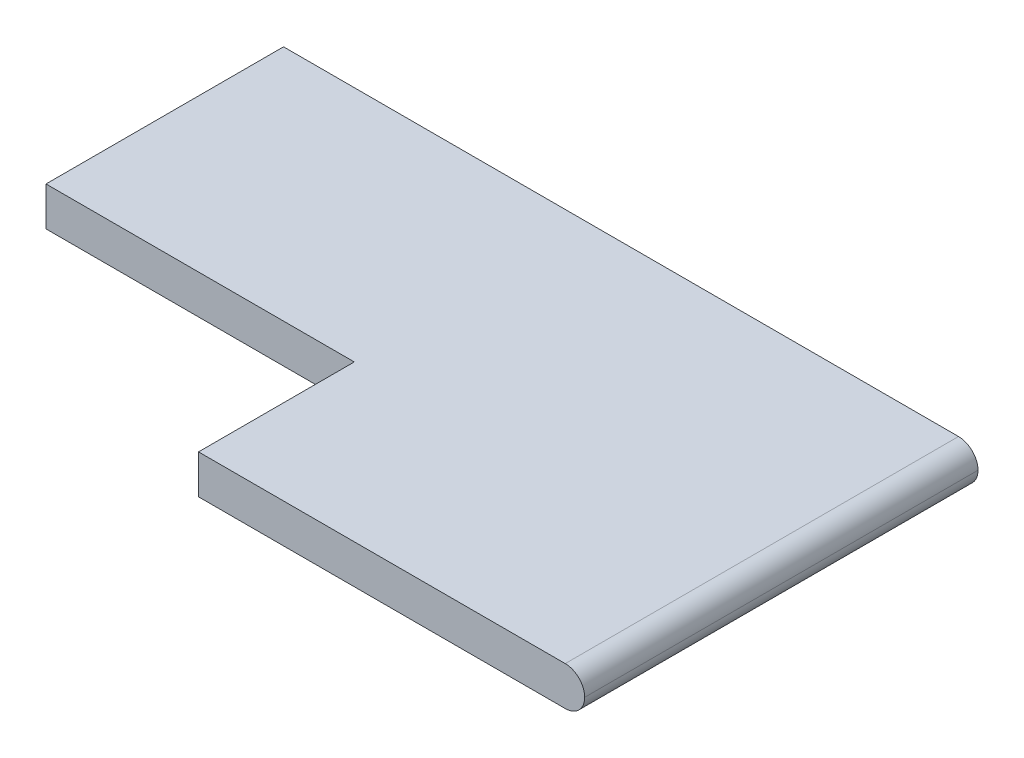
ISO-10303-21;
HEADER;
FILE_DESCRIPTION(('STEP AP214'),'2;1');
FILE_NAME('part.step','',(''),(''),'','','');
FILE_SCHEMA(('AUTOMOTIVE_DESIGN { 1 0 10303 214 1 1 1 1 }'));
ENDSEC;
DATA;
#1=APPLICATION_CONTEXT('core data for automotive mechanical design processes');
#2=APPLICATION_PROTOCOL_DEFINITION('international standard','automotive_design',2000,#1);
#3=PRODUCT_CONTEXT('',#1,'mechanical');
#4=PRODUCT('Part','Part','',(#3));
#5=PRODUCT_RELATED_PRODUCT_CATEGORY('part','',(#4));
#6=PRODUCT_DEFINITION_FORMATION('','',#4);
#7=PRODUCT_DEFINITION_CONTEXT('part definition',#1,'design');
#8=PRODUCT_DEFINITION('design','',#6,#7);
#9=PRODUCT_DEFINITION_SHAPE('','',#8);
#10=(LENGTH_UNIT() NAMED_UNIT(*) SI_UNIT(.MILLI.,.METRE.));
#11=(NAMED_UNIT(*) PLANE_ANGLE_UNIT() SI_UNIT($,.RADIAN.));
#12=(NAMED_UNIT(*) SI_UNIT($,.STERADIAN.) SOLID_ANGLE_UNIT());
#13=UNCERTAINTY_MEASURE_WITH_UNIT(LENGTH_MEASURE(1.E-05),#10,'distance_accuracy_value','');
#14=(GEOMETRIC_REPRESENTATION_CONTEXT(3) GLOBAL_UNCERTAINTY_ASSIGNED_CONTEXT((#13)) GLOBAL_UNIT_ASSIGNED_CONTEXT((#10,
#11,#12)) REPRESENTATION_CONTEXT('',''));
#15=CARTESIAN_POINT('',(0.,0.,0.));
#16=DIRECTION('',(0.,0.,1.));
#17=DIRECTION('',(1.,0.,0.));
#18=AXIS2_PLACEMENT_3D('',#15,#16,#17);
#19=CARTESIAN_POINT('',(-4.25,0.,83.8840461331542));
#20=DIRECTION('',(1.,0.,0.));
#21=DIRECTION('',(0.,0.,-1.));
#22=AXIS2_PLACEMENT_3D('',#19,#20,#21);
#23=PLANE('',#22);
#24=DIRECTION('',(0.,-1.,0.));
#25=VECTOR('',#24,1.);
#26=CARTESIAN_POINT('',(-4.25,1.5,18.3));
#27=LINE('',#26,#25);
#28=CARTESIAN_POINT('',(-4.25,1.5,18.3));
#29=VERTEX_POINT('',#28);
#30=CARTESIAN_POINT('',(-4.25,-1.5,18.3));
#31=VERTEX_POINT('',#30);
#32=EDGE_CURVE('E95',#29,#31,#27,.T.);
#33=ORIENTED_EDGE('',*,*,#32,.F.);
#34=DIRECTION('',(0.,0.,-1.));
#35=VECTOR('',#34,1.);
#36=CARTESIAN_POINT('',(-4.25,1.5,83.8840461331542));
#37=LINE('',#36,#35);
#38=CARTESIAN_POINT('',(-4.25,1.5,0.));
#39=VERTEX_POINT('',#38);
#40=EDGE_CURVE('E121',#29,#39,#37,.T.);
#41=ORIENTED_EDGE('',*,*,#40,.T.);
#42=DIRECTION('',(0.,-1.,0.));
#43=VECTOR('',#42,1.);
#44=CARTESIAN_POINT('',(-4.25,0.,0.));
#45=LINE('',#44,#43);
#46=CARTESIAN_POINT('',(-4.25,-1.5,0.));
#47=VERTEX_POINT('',#46);
#48=EDGE_CURVE('E115',#39,#47,#45,.T.);
#49=ORIENTED_EDGE('',*,*,#48,.T.);
#50=DIRECTION('',(0.,0.,-1.));
#51=VECTOR('',#50,1.);
#52=CARTESIAN_POINT('',(-4.25,-1.5,83.8840461331542));
#53=LINE('',#52,#51);
#54=EDGE_CURVE('E109',#31,#47,#53,.T.);
#55=ORIENTED_EDGE('',*,*,#54,.F.);
#56=EDGE_LOOP('',(#33,#41,#49,#55));
#57=FACE_BOUND('',#56,.T.);
#58=ADVANCED_FACE('F35',(#57),#23,.F.);
#59=CARTESIAN_POINT('',(0.,1.5,83.8840461331542));
#60=DIRECTION('',(0.,1.,0.));
#61=DIRECTION('',(0.,0.,1.));
#62=AXIS2_PLACEMENT_3D('',#59,#60,#61);
#63=PLANE('',#62);
#64=DIRECTION('',(1.,0.,0.));
#65=VECTOR('',#64,1.);
#66=CARTESIAN_POINT('',(0.,1.5,30.3));
#67=LINE('',#66,#65);
#68=CARTESIAN_POINT('',(19.5,1.5,30.3));
#69=VERTEX_POINT('',#68);
#70=CARTESIAN_POINT('',(47.75,1.5,30.3));
#71=VERTEX_POINT('',#70);
#72=EDGE_CURVE('E140',#69,#71,#67,.T.);
#73=ORIENTED_EDGE('',*,*,#72,.T.);
#74=DIRECTION('',(0.,0.,-1.));
#75=VECTOR('',#74,1.);
#76=CARTESIAN_POINT('',(47.75,1.5,83.8840461331542));
#77=LINE('',#76,#75);
#78=CARTESIAN_POINT('',(47.75,1.5,0.));
#79=VERTEX_POINT('',#78);
#80=EDGE_CURVE('E126',#71,#79,#77,.T.);
#81=ORIENTED_EDGE('',*,*,#80,.T.);
#82=DIRECTION('',(1.,0.,0.));
#83=VECTOR('',#82,1.);
#84=CARTESIAN_POINT('',(0.,1.5,0.));
#85=LINE('',#84,#83);
#86=EDGE_CURVE('E119',#39,#79,#85,.T.);
#87=ORIENTED_EDGE('',*,*,#86,.F.);
#88=ORIENTED_EDGE('',*,*,#40,.F.);
#89=DIRECTION('',(-1.,0.,0.));
#90=VECTOR('',#89,1.);
#91=CARTESIAN_POINT('',(-4.25,1.5,18.3));
#92=LINE('',#91,#90);
#93=CARTESIAN_POINT('',(19.5,1.5,18.3));
#94=VERTEX_POINT('',#93);
#95=EDGE_CURVE('E102',#94,#29,#92,.T.);
#96=ORIENTED_EDGE('',*,*,#95,.F.);
#97=DIRECTION('',(0.,0.,1.));
#98=VECTOR('',#97,1.);
#99=CARTESIAN_POINT('',(19.5,1.5,18.3));
#100=LINE('',#99,#98);
#101=EDGE_CURVE('E149',#94,#69,#100,.T.);
#102=ORIENTED_EDGE('',*,*,#101,.T.);
#103=EDGE_LOOP('',(#73,#81,#87,#88,#96,#102));
#104=FACE_BOUND('',#103,.T.);
#105=ADVANCED_FACE('F146',(#104),#63,.T.);
#106=CARTESIAN_POINT('',(0.,-1.5,83.8840461331542));
#107=DIRECTION('',(0.,1.,0.));
#108=DIRECTION('',(0.,0.,1.));
#109=AXIS2_PLACEMENT_3D('',#106,#107,#108);
#110=PLANE('',#109);
#111=DIRECTION('',(1.,0.,0.));
#112=VECTOR('',#111,1.);
#113=CARTESIAN_POINT('',(0.,-1.5,0.));
#114=LINE('',#113,#112);
#115=CARTESIAN_POINT('',(47.75,-1.5,0.));
#116=VERTEX_POINT('',#115);
#117=EDGE_CURVE('E117',#47,#116,#114,.T.);
#118=ORIENTED_EDGE('',*,*,#117,.T.);
#119=DIRECTION('',(0.,0.,-1.));
#120=VECTOR('',#119,1.);
#121=CARTESIAN_POINT('',(47.75,-1.5,30.3));
#122=LINE('',#121,#120);
#123=CARTESIAN_POINT('',(47.75,-1.5,30.3));
#124=VERTEX_POINT('',#123);
#125=EDGE_CURVE('E11',#116,#124,#122,.F.);
#126=ORIENTED_EDGE('',*,*,#125,.T.);
#127=DIRECTION('',(1.,0.,0.));
#128=VECTOR('',#127,1.);
#129=CARTESIAN_POINT('',(0.,-1.5,30.3));
#130=LINE('',#129,#128);
#131=CARTESIAN_POINT('',(19.5,-1.5,30.3));
#132=VERTEX_POINT('',#131);
#133=EDGE_CURVE('E130',#132,#124,#130,.T.);
#134=ORIENTED_EDGE('',*,*,#133,.F.);
#135=DIRECTION('',(0.,0.,1.));
#136=VECTOR('',#135,1.);
#137=CARTESIAN_POINT('',(19.5,-1.5,18.3));
#138=LINE('',#137,#136);
#139=CARTESIAN_POINT('',(19.5,-1.5,18.3));
#140=VERTEX_POINT('',#139);
#141=EDGE_CURVE('E111',#140,#132,#138,.T.);
#142=ORIENTED_EDGE('',*,*,#141,.F.);
#143=DIRECTION('',(1.,0.,0.));
#144=VECTOR('',#143,1.);
#145=CARTESIAN_POINT('',(-4.25,-1.5,18.3));
#146=LINE('',#145,#144);
#147=EDGE_CURVE('E99',#31,#140,#146,.T.);
#148=ORIENTED_EDGE('',*,*,#147,.F.);
#149=ORIENTED_EDGE('',*,*,#54,.T.);
#150=EDGE_LOOP('',(#118,#126,#134,#142,#148,#149));
#151=FACE_BOUND('',#150,.T.);
#152=ADVANCED_FACE('F108',(#151),#110,.F.);
#153=CARTESIAN_POINT('',(0.,0.,0.));
#154=DIRECTION('',(0.,0.,1.));
#155=DIRECTION('',(1.,0.,0.));
#156=AXIS2_PLACEMENT_3D('',#153,#154,#155);
#157=PLANE('',#156);
#158=ORIENTED_EDGE('',*,*,#86,.T.);
#159=CARTESIAN_POINT('',(47.75,0.,0.));
#160=DIRECTION('',(0.,0.,1.));
#161=DIRECTION('',(1.,0.,0.));
#162=AXIS2_PLACEMENT_3D('',#159,#160,#161);
#163=CIRCLE('',#162,1.5);
#164=CARTESIAN_POINT('',(49.25,0.,0.));
#165=VERTEX_POINT('',#164);
#166=EDGE_CURVE('E132',#79,#165,#163,.F.);
#167=ORIENTED_EDGE('',*,*,#166,.T.);
#168=CARTESIAN_POINT('',(47.75,0.,0.));
#169=DIRECTION('',(0.,0.,1.));
#170=DIRECTION('',(1.,0.,0.));
#171=AXIS2_PLACEMENT_3D('',#168,#169,#170);
#172=CIRCLE('',#171,1.5);
#173=EDGE_CURVE('E129',#165,#116,#172,.F.);
#174=ORIENTED_EDGE('',*,*,#173,.T.);
#175=ORIENTED_EDGE('',*,*,#117,.F.);
#176=ORIENTED_EDGE('',*,*,#48,.F.);
#177=EDGE_LOOP('',(#158,#167,#174,#175,#176));
#178=FACE_BOUND('',#177,.T.);
#179=ADVANCED_FACE('F154',(#178),#157,.F.);
#180=CARTESIAN_POINT('',(0.,0.,30.3));
#181=DIRECTION('',(0.,0.,1.));
#182=DIRECTION('',(1.,0.,0.));
#183=AXIS2_PLACEMENT_3D('',#180,#181,#182);
#184=PLANE('',#183);
#185=CARTESIAN_POINT('',(47.75,0.,30.3));
#186=DIRECTION('',(0.,0.,1.));
#187=DIRECTION('',(1.,0.,0.));
#188=AXIS2_PLACEMENT_3D('',#185,#186,#187);
#189=CIRCLE('',#188,1.5);
#190=CARTESIAN_POINT('',(49.25,0.,30.3));
#191=VERTEX_POINT('',#190);
#192=EDGE_CURVE('E51',#124,#191,#189,.T.);
#193=ORIENTED_EDGE('',*,*,#192,.T.);
#194=CARTESIAN_POINT('',(47.75,0.,30.3));
#195=DIRECTION('',(0.,0.,1.));
#196=DIRECTION('',(1.,0.,0.));
#197=AXIS2_PLACEMENT_3D('',#194,#195,#196);
#198=CIRCLE('',#197,1.5);
#199=EDGE_CURVE('E44',#191,#71,#198,.T.);
#200=ORIENTED_EDGE('',*,*,#199,.T.);
#201=ORIENTED_EDGE('',*,*,#72,.F.);
#202=DIRECTION('',(0.,1.,0.));
#203=VECTOR('',#202,1.);
#204=CARTESIAN_POINT('',(19.5,1.5,30.3));
#205=LINE('',#204,#203);
#206=EDGE_CURVE('E106',#132,#69,#205,.T.);
#207=ORIENTED_EDGE('',*,*,#206,.F.);
#208=ORIENTED_EDGE('',*,*,#133,.T.);
#209=EDGE_LOOP('',(#193,#200,#201,#207,#208));
#210=FACE_BOUND('',#209,.T.);
#211=ADVANCED_FACE('F138',(#210),#184,.T.);
#212=CARTESIAN_POINT('',(19.5,1.5,18.3));
#213=DIRECTION('',(1.,0.,0.));
#214=DIRECTION('',(0.,0.,-1.));
#215=AXIS2_PLACEMENT_3D('',#212,#213,#214);
#216=PLANE('',#215);
#217=ORIENTED_EDGE('',*,*,#206,.T.);
#218=ORIENTED_EDGE('',*,*,#101,.F.);
#219=DIRECTION('',(0.,1.,0.));
#220=VECTOR('',#219,1.);
#221=CARTESIAN_POINT('',(19.5,1.5,18.3));
#222=LINE('',#221,#220);
#223=EDGE_CURVE('E112',#140,#94,#222,.T.);
#224=ORIENTED_EDGE('',*,*,#223,.F.);
#225=ORIENTED_EDGE('',*,*,#141,.T.);
#226=EDGE_LOOP('',(#217,#218,#224,#225));
#227=FACE_BOUND('',#226,.T.);
#228=ADVANCED_FACE('F163',(#227),#216,.F.);
#229=CARTESIAN_POINT('',(0.,0.,18.3));
#230=DIRECTION('',(0.,0.,1.));
#231=DIRECTION('',(1.,0.,0.));
#232=AXIS2_PLACEMENT_3D('',#229,#230,#231);
#233=PLANE('',#232);
#234=ORIENTED_EDGE('',*,*,#32,.T.);
#235=ORIENTED_EDGE('',*,*,#147,.T.);
#236=ORIENTED_EDGE('',*,*,#223,.T.);
#237=ORIENTED_EDGE('',*,*,#95,.T.);
#238=EDGE_LOOP('',(#234,#235,#236,#237));
#239=FACE_BOUND('',#238,.T.);
#240=ADVANCED_FACE('F97',(#239),#233,.T.);
#241=CARTESIAN_POINT('',(47.75,0.,83.8840461331542));
#242=DIRECTION('',(0.,0.,1.));
#243=DIRECTION('',(1.,0.,0.));
#244=AXIS2_PLACEMENT_3D('',#241,#242,#243);
#245=CYLINDRICAL_SURFACE('',#244,1.5);
#246=DIRECTION('',(0.,0.,-1.));
#247=VECTOR('',#246,1.);
#248=CARTESIAN_POINT('',(49.25,0.,0.));
#249=LINE('',#248,#247);
#250=EDGE_CURVE('E39',#191,#165,#249,.T.);
#251=ORIENTED_EDGE('',*,*,#250,.F.);
#252=ORIENTED_EDGE('',*,*,#192,.F.);
#253=ORIENTED_EDGE('',*,*,#125,.F.);
#254=ORIENTED_EDGE('',*,*,#173,.F.);
#255=EDGE_LOOP('',(#251,#252,#253,#254));
#256=FACE_BOUND('',#255,.T.);
#257=ADVANCED_FACE('F37',(#256),#245,.T.);
#258=CARTESIAN_POINT('',(47.75,0.,83.8840461331542));
#259=DIRECTION('',(0.,0.,-1.));
#260=DIRECTION('',(-1.,0.,0.));
#261=AXIS2_PLACEMENT_3D('',#258,#259,#260);
#262=CYLINDRICAL_SURFACE('',#261,1.5);
#263=ORIENTED_EDGE('',*,*,#199,.F.);
#264=ORIENTED_EDGE('',*,*,#250,.T.);
#265=ORIENTED_EDGE('',*,*,#166,.F.);
#266=ORIENTED_EDGE('',*,*,#80,.F.);
#267=EDGE_LOOP('',(#263,#264,#265,#266));
#268=FACE_BOUND('',#267,.T.);
#269=ADVANCED_FACE('F151',(#268),#262,.T.);
#270=CLOSED_SHELL('',(#58,#105,#152,#179,#211,#228,#240,#257,#269));
#271=MANIFOLD_SOLID_BREP('B2',#270);
#272=ADVANCED_BREP_SHAPE_REPRESENTATION('',(#18,#271),#14);
#273=SHAPE_DEFINITION_REPRESENTATION(#9,#272);
ENDSEC;
END-ISO-10303-21;
